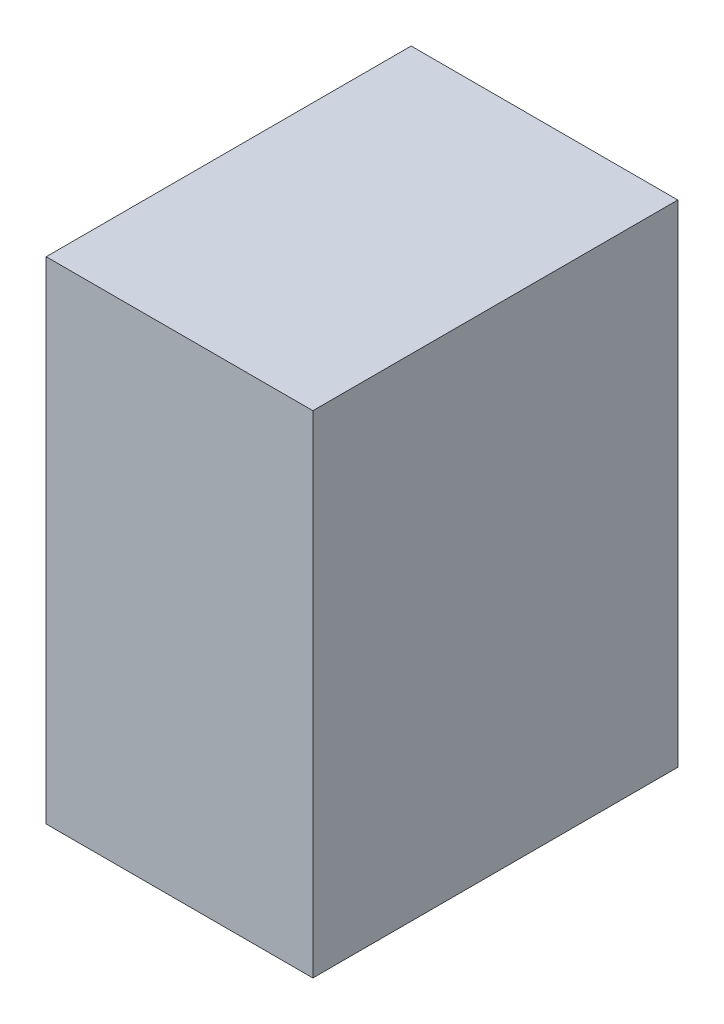
ISO-10303-21;
HEADER;
FILE_DESCRIPTION(('STEP AP214'),'2;1');
FILE_NAME('part.step','',(''),(''),'','','');
FILE_SCHEMA(('AUTOMOTIVE_DESIGN { 1 0 10303 214 1 1 1 1 }'));
ENDSEC;
DATA;
#1=APPLICATION_CONTEXT('core data for automotive mechanical design processes');
#2=APPLICATION_PROTOCOL_DEFINITION('international standard','automotive_design',2000,#1);
#3=PRODUCT_CONTEXT('',#1,'mechanical');
#4=PRODUCT('Part','Part','',(#3));
#5=PRODUCT_RELATED_PRODUCT_CATEGORY('part','',(#4));
#6=PRODUCT_DEFINITION_FORMATION('','',#4);
#7=PRODUCT_DEFINITION_CONTEXT('part definition',#1,'design');
#8=PRODUCT_DEFINITION('design','',#6,#7);
#9=PRODUCT_DEFINITION_SHAPE('','',#8);
#10=(LENGTH_UNIT() NAMED_UNIT(*) SI_UNIT(.MILLI.,.METRE.));
#11=(NAMED_UNIT(*) PLANE_ANGLE_UNIT() SI_UNIT($,.RADIAN.));
#12=(NAMED_UNIT(*) SI_UNIT($,.STERADIAN.) SOLID_ANGLE_UNIT());
#13=UNCERTAINTY_MEASURE_WITH_UNIT(LENGTH_MEASURE(1.E-05),#10,'distance_accuracy_value','');
#14=(GEOMETRIC_REPRESENTATION_CONTEXT(3) GLOBAL_UNCERTAINTY_ASSIGNED_CONTEXT((#13)) GLOBAL_UNIT_ASSIGNED_CONTEXT((#10,
#11,#12)) REPRESENTATION_CONTEXT('',''));
#15=CARTESIAN_POINT('',(0.,0.,0.));
#16=DIRECTION('',(0.,0.,1.));
#17=DIRECTION('',(1.,0.,0.));
#18=AXIS2_PLACEMENT_3D('',#15,#16,#17);
#19=CARTESIAN_POINT('',(-0.47500032,0.87499952,0.));
#20=DIRECTION('',(1.,0.,0.));
#21=DIRECTION('',(0.,0.,-1.));
#22=AXIS2_PLACEMENT_3D('',#19,#20,#21);
#23=PLANE('',#22);
#24=DIRECTION('',(0.,0.,1.));
#25=VECTOR('',#24,1.);
#26=CARTESIAN_POINT('',(-0.47500032,-0.87499952,0.));
#27=LINE('',#26,#25);
#28=CARTESIAN_POINT('',(-0.47500032,-0.87499952,0.));
#29=VERTEX_POINT('',#28);
#30=CARTESIAN_POINT('',(-0.47500032,-0.87499952,1.29999994));
#31=VERTEX_POINT('',#30);
#32=EDGE_CURVE('E19',#29,#31,#27,.T.);
#33=ORIENTED_EDGE('',*,*,#32,.T.);
#34=DIRECTION('',(0.,1.,0.));
#35=VECTOR('',#34,1.);
#36=CARTESIAN_POINT('',(-0.47500032,-0.87499952,1.29999994));
#37=LINE('',#36,#35);
#38=CARTESIAN_POINT('',(-0.47500032,0.87499952,1.29999994));
#39=VERTEX_POINT('',#38);
#40=EDGE_CURVE('E54',#31,#39,#37,.T.);
#41=ORIENTED_EDGE('',*,*,#40,.T.);
#42=DIRECTION('',(0.,0.,-1.));
#43=VECTOR('',#42,1.);
#44=CARTESIAN_POINT('',(-0.47500032,0.87499952,0.));
#45=LINE('',#44,#43);
#46=CARTESIAN_POINT('',(-0.47500032,0.87499952,0.));
#47=VERTEX_POINT('',#46);
#48=EDGE_CURVE('E75',#39,#47,#45,.T.);
#49=ORIENTED_EDGE('',*,*,#48,.T.);
#50=DIRECTION('',(0.,1.,0.));
#51=VECTOR('',#50,1.);
#52=CARTESIAN_POINT('',(-0.47500032,-0.87499952,0.));
#53=LINE('',#52,#51);
#54=EDGE_CURVE('E57',#29,#47,#53,.T.);
#55=ORIENTED_EDGE('',*,*,#54,.F.);
#56=EDGE_LOOP('',(#33,#41,#49,#55));
#57=FACE_BOUND('',#56,.T.);
#58=ADVANCED_FACE('F16',(#57),#23,.F.);
#59=CARTESIAN_POINT('',(-0.47500032,-0.87499952,0.));
#60=DIRECTION('',(0.,1.,0.));
#61=DIRECTION('',(0.,0.,1.));
#62=AXIS2_PLACEMENT_3D('',#59,#60,#61);
#63=PLANE('',#62);
#64=DIRECTION('',(0.,0.,1.));
#65=VECTOR('',#64,1.);
#66=CARTESIAN_POINT('',(0.47500032,-0.87499952,0.));
#67=LINE('',#66,#65);
#68=CARTESIAN_POINT('',(0.47500032,-0.87499952,0.));
#69=VERTEX_POINT('',#68);
#70=CARTESIAN_POINT('',(0.47500032,-0.87499952,1.29999994));
#71=VERTEX_POINT('',#70);
#72=EDGE_CURVE('E72',#69,#71,#67,.T.);
#73=ORIENTED_EDGE('',*,*,#72,.T.);
#74=DIRECTION('',(-1.,0.,0.));
#75=VECTOR('',#74,1.);
#76=CARTESIAN_POINT('',(0.47500032,-0.87499952,1.29999994));
#77=LINE('',#76,#75);
#78=EDGE_CURVE('E62',#71,#31,#77,.T.);
#79=ORIENTED_EDGE('',*,*,#78,.T.);
#80=ORIENTED_EDGE('',*,*,#32,.F.);
#81=DIRECTION('',(-1.,0.,0.));
#82=VECTOR('',#81,1.);
#83=CARTESIAN_POINT('',(0.47500032,-0.87499952,0.));
#84=LINE('',#83,#82);
#85=EDGE_CURVE('E77',#69,#29,#84,.T.);
#86=ORIENTED_EDGE('',*,*,#85,.F.);
#87=EDGE_LOOP('',(#73,#79,#80,#86));
#88=FACE_BOUND('',#87,.T.);
#89=ADVANCED_FACE('F71',(#88),#63,.F.);
#90=CARTESIAN_POINT('',(0.47500032,-0.87499952,1.29999994));
#91=DIRECTION('',(0.,0.,-1.));
#92=DIRECTION('',(-1.,0.,0.));
#93=AXIS2_PLACEMENT_3D('',#90,#91,#92);
#94=PLANE('',#93);
#95=DIRECTION('',(1.,0.,0.));
#96=VECTOR('',#95,1.);
#97=CARTESIAN_POINT('',(0.47500032,0.87499952,1.29999994));
#98=LINE('',#97,#96);
#99=CARTESIAN_POINT('',(0.47500032,0.87499952,1.29999994));
#100=VERTEX_POINT('',#99);
#101=EDGE_CURVE('E68',#100,#39,#98,.F.);
#102=ORIENTED_EDGE('',*,*,#101,.T.);
#103=ORIENTED_EDGE('',*,*,#40,.F.);
#104=ORIENTED_EDGE('',*,*,#78,.F.);
#105=DIRECTION('',(0.,1.,0.));
#106=VECTOR('',#105,1.);
#107=CARTESIAN_POINT('',(0.47500032,-0.87499952,1.29999994));
#108=LINE('',#107,#106);
#109=EDGE_CURVE('E82',#71,#100,#108,.T.);
#110=ORIENTED_EDGE('',*,*,#109,.T.);
#111=EDGE_LOOP('',(#102,#103,#104,#110));
#112=FACE_BOUND('',#111,.T.);
#113=ADVANCED_FACE('F65',(#112),#94,.F.);
#114=CARTESIAN_POINT('',(0.47500032,0.87499952,0.));
#115=DIRECTION('',(0.,-1.,0.));
#116=DIRECTION('',(0.,0.,-1.));
#117=AXIS2_PLACEMENT_3D('',#114,#115,#116);
#118=PLANE('',#117);
#119=ORIENTED_EDGE('',*,*,#48,.F.);
#120=ORIENTED_EDGE('',*,*,#101,.F.);
#121=DIRECTION('',(0.,0.,1.));
#122=VECTOR('',#121,1.);
#123=CARTESIAN_POINT('',(0.47500032,0.87499952,0.));
#124=LINE('',#123,#122);
#125=CARTESIAN_POINT('',(0.47500032,0.87499952,0.));
#126=VERTEX_POINT('',#125);
#127=EDGE_CURVE('E25',#100,#126,#124,.F.);
#128=ORIENTED_EDGE('',*,*,#127,.T.);
#129=DIRECTION('',(-1.,0.,0.));
#130=VECTOR('',#129,1.);
#131=CARTESIAN_POINT('',(0.47500032,0.87499952,0.));
#132=LINE('',#131,#130);
#133=EDGE_CURVE('E33',#47,#126,#132,.F.);
#134=ORIENTED_EDGE('',*,*,#133,.F.);
#135=EDGE_LOOP('',(#119,#120,#128,#134));
#136=FACE_BOUND('',#135,.T.);
#137=ADVANCED_FACE('F87',(#136),#118,.F.);
#138=CARTESIAN_POINT('',(0.47500032,-0.87499952,0.));
#139=DIRECTION('',(0.,0.,-1.));
#140=DIRECTION('',(-1.,0.,0.));
#141=AXIS2_PLACEMENT_3D('',#138,#139,#140);
#142=PLANE('',#141);
#143=ORIENTED_EDGE('',*,*,#133,.T.);
#144=DIRECTION('',(0.,1.,0.));
#145=VECTOR('',#144,1.);
#146=CARTESIAN_POINT('',(0.47500032,-0.87499952,0.));
#147=LINE('',#146,#145);
#148=EDGE_CURVE('E11',#126,#69,#147,.F.);
#149=ORIENTED_EDGE('',*,*,#148,.T.);
#150=ORIENTED_EDGE('',*,*,#85,.T.);
#151=ORIENTED_EDGE('',*,*,#54,.T.);
#152=EDGE_LOOP('',(#143,#149,#150,#151));
#153=FACE_BOUND('',#152,.T.);
#154=ADVANCED_FACE('F90',(#153),#142,.T.);
#155=CARTESIAN_POINT('',(0.47500032,-0.87499952,0.));
#156=DIRECTION('',(-1.,0.,0.));
#157=DIRECTION('',(0.,0.,1.));
#158=AXIS2_PLACEMENT_3D('',#155,#156,#157);
#159=PLANE('',#158);
#160=ORIENTED_EDGE('',*,*,#127,.F.);
#161=ORIENTED_EDGE('',*,*,#109,.F.);
#162=ORIENTED_EDGE('',*,*,#72,.F.);
#163=ORIENTED_EDGE('',*,*,#148,.F.);
#164=EDGE_LOOP('',(#160,#161,#162,#163));
#165=FACE_BOUND('',#164,.T.);
#166=ADVANCED_FACE('F89',(#165),#159,.F.);
#167=CLOSED_SHELL('',(#58,#89,#113,#137,#154,#166));
#168=MANIFOLD_SOLID_BREP('B1',#167);
#169=ADVANCED_BREP_SHAPE_REPRESENTATION('',(#18,#168),#14);
#170=SHAPE_DEFINITION_REPRESENTATION(#9,#169);
ENDSEC;
END-ISO-10303-21;
